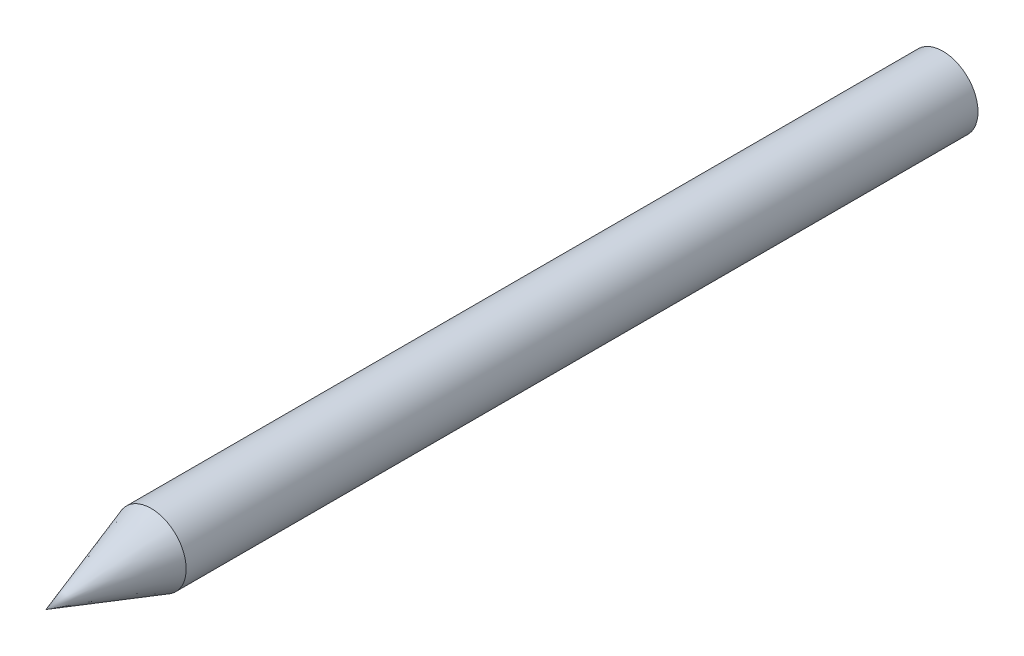
ISO-10303-21;
HEADER;
FILE_DESCRIPTION(('STEP AP214'),'2;1');
FILE_NAME('part.step','',(''),(''),'','','');
FILE_SCHEMA(('AUTOMOTIVE_DESIGN { 1 0 10303 214 1 1 1 1 }'));
ENDSEC;
DATA;
#1=APPLICATION_CONTEXT('core data for automotive mechanical design processes');
#2=APPLICATION_PROTOCOL_DEFINITION('international standard','automotive_design',2000,#1);
#3=PRODUCT_CONTEXT('',#1,'mechanical');
#4=PRODUCT('Part','Part','',(#3));
#5=PRODUCT_RELATED_PRODUCT_CATEGORY('part','',(#4));
#6=PRODUCT_DEFINITION_FORMATION('','',#4);
#7=PRODUCT_DEFINITION_CONTEXT('part definition',#1,'design');
#8=PRODUCT_DEFINITION('design','',#6,#7);
#9=PRODUCT_DEFINITION_SHAPE('','',#8);
#10=(LENGTH_UNIT() NAMED_UNIT(*) SI_UNIT(.MILLI.,.METRE.));
#11=(NAMED_UNIT(*) PLANE_ANGLE_UNIT() SI_UNIT($,.RADIAN.));
#12=(NAMED_UNIT(*) SI_UNIT($,.STERADIAN.) SOLID_ANGLE_UNIT());
#13=UNCERTAINTY_MEASURE_WITH_UNIT(LENGTH_MEASURE(1.E-05),#10,'distance_accuracy_value','');
#14=(GEOMETRIC_REPRESENTATION_CONTEXT(3) GLOBAL_UNCERTAINTY_ASSIGNED_CONTEXT((#13)) GLOBAL_UNIT_ASSIGNED_CONTEXT((#10,
#11,#12)) REPRESENTATION_CONTEXT('',''));
#15=CARTESIAN_POINT('',(0.,0.,0.));
#16=DIRECTION('',(0.,0.,1.));
#17=DIRECTION('',(1.,0.,0.));
#18=AXIS2_PLACEMENT_3D('',#15,#16,#17);
#19=CARTESIAN_POINT('',(0.,0.,128.));
#20=DIRECTION('',(0.,0.,-1.));
#21=DIRECTION('',(-1.,0.,0.));
#22=AXIS2_PLACEMENT_3D('',#19,#20,#21);
#23=CYLINDRICAL_SURFACE('',#22,5.);
#24=CARTESIAN_POINT('',(0.,0.,113.));
#25=DIRECTION('',(0.,0.,1.));
#26=DIRECTION('',(1.,0.,0.));
#27=AXIS2_PLACEMENT_3D('',#24,#25,#26);
#28=CIRCLE('',#27,5.);
#29=CARTESIAN_POINT('',(5.,0.,113.));
#30=VERTEX_POINT('',#29);
#31=EDGE_CURVE('E11',#30,#30,#28,.F.);
#32=ORIENTED_EDGE('',*,*,#31,.T.);
#33=EDGE_LOOP('',(#32));
#34=FACE_BOUND('',#33,.T.);
#35=CARTESIAN_POINT('',(0.,0.,0.));
#36=DIRECTION('',(0.,0.,1.));
#37=DIRECTION('',(1.,0.,0.));
#38=AXIS2_PLACEMENT_3D('',#35,#36,#37);
#39=CIRCLE('',#38,5.);
#40=CARTESIAN_POINT('',(5.,0.,0.));
#41=VERTEX_POINT('',#40);
#42=EDGE_CURVE('E50',#41,#41,#39,.T.);
#43=ORIENTED_EDGE('',*,*,#42,.T.);
#44=EDGE_LOOP('',(#43));
#45=FACE_BOUND('',#44,.T.);
#46=ADVANCED_FACE('F42',(#34,#45),#23,.T.);
#47=CARTESIAN_POINT('',(0.,0.,0.));
#48=DIRECTION('',(0.,0.,1.));
#49=DIRECTION('',(1.,0.,0.));
#50=AXIS2_PLACEMENT_3D('',#47,#48,#49);
#51=PLANE('',#50);
#52=ORIENTED_EDGE('',*,*,#42,.F.);
#53=EDGE_LOOP('',(#52));
#54=FACE_BOUND('',#53,.T.);
#55=ADVANCED_FACE('F54',(#54),#51,.F.);
#56=CARTESIAN_POINT('',(0.,0.,113.));
#57=DIRECTION('',(0.,0.,-1.));
#58=DIRECTION('',(-1.,0.,0.));
#59=AXIS2_PLACEMENT_3D('',#56,#57,#58);
#60=CONICAL_SURFACE('',#59,4.99999999999997,0.32175055439664);
#61=ORIENTED_EDGE('',*,*,#31,.F.);
#62=EDGE_LOOP('',(#61));
#63=FACE_BOUND('',#62,.T.);
#64=CARTESIAN_POINT('',(0.,0.,128.));
#65=VERTEX_POINT('',#64);
#66=VERTEX_LOOP('',#65);
#67=FACE_BOUND('',#66,.T.);
#68=ADVANCED_FACE('F44',(#63,#67),#60,.T.);
#69=CLOSED_SHELL('',(#46,#55,#68));
#70=MANIFOLD_SOLID_BREP('B2',#69);
#71=ADVANCED_BREP_SHAPE_REPRESENTATION('',(#18,#70),#14);
#72=SHAPE_DEFINITION_REPRESENTATION(#9,#71);
ENDSEC;
END-ISO-10303-21;
